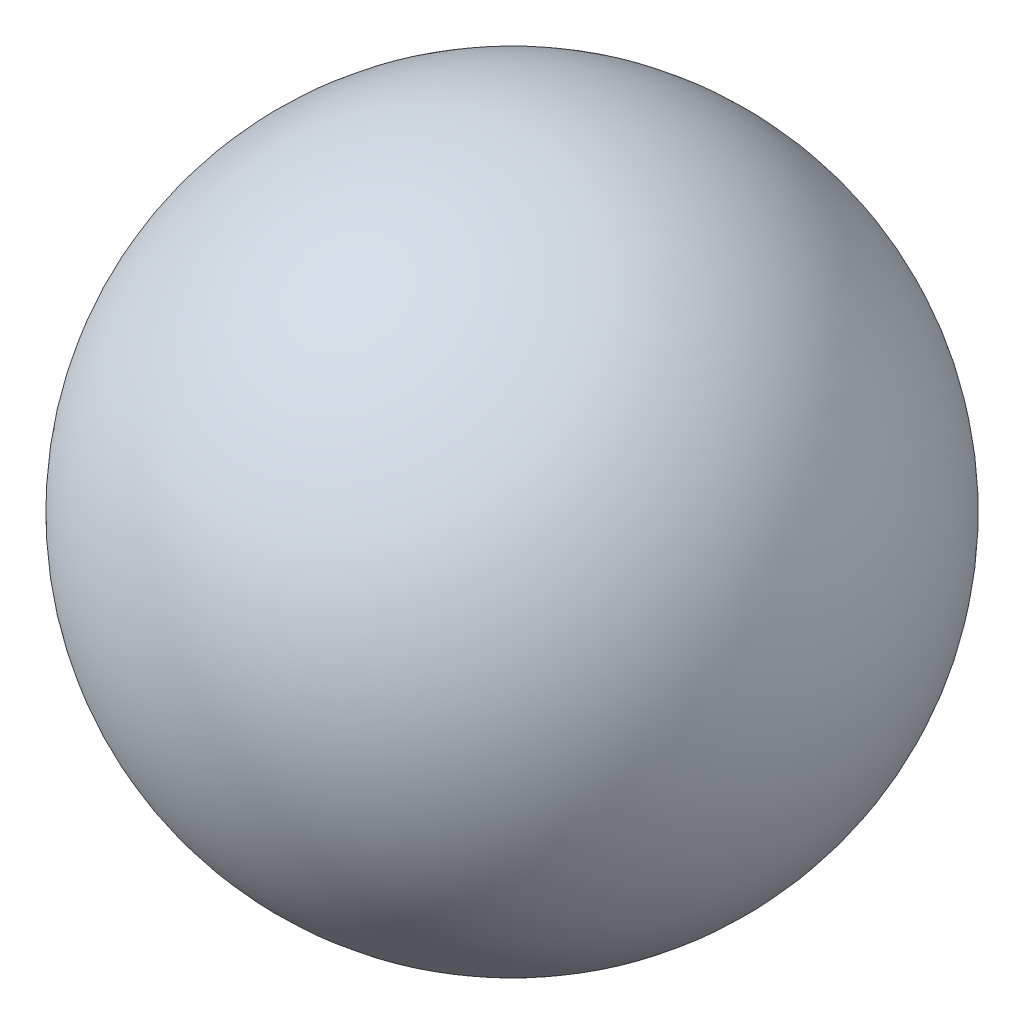
ISO-10303-21;
HEADER;
FILE_DESCRIPTION(('STEP AP214'),'2;1');
FILE_NAME('part.step','',(''),(''),'','','');
FILE_SCHEMA(('AUTOMOTIVE_DESIGN { 1 0 10303 214 1 1 1 1 }'));
ENDSEC;
DATA;
#1=APPLICATION_CONTEXT('core data for automotive mechanical design processes');
#2=APPLICATION_PROTOCOL_DEFINITION('international standard','automotive_design',2000,#1);
#3=PRODUCT_CONTEXT('',#1,'mechanical');
#4=PRODUCT('Part','Part','',(#3));
#5=PRODUCT_RELATED_PRODUCT_CATEGORY('part','',(#4));
#6=PRODUCT_DEFINITION_FORMATION('','',#4);
#7=PRODUCT_DEFINITION_CONTEXT('part definition',#1,'design');
#8=PRODUCT_DEFINITION('design','',#6,#7);
#9=PRODUCT_DEFINITION_SHAPE('','',#8);
#10=(LENGTH_UNIT() NAMED_UNIT(*) SI_UNIT(.MILLI.,.METRE.));
#11=(NAMED_UNIT(*) PLANE_ANGLE_UNIT() SI_UNIT($,.RADIAN.));
#12=(NAMED_UNIT(*) SI_UNIT($,.STERADIAN.) SOLID_ANGLE_UNIT());
#13=UNCERTAINTY_MEASURE_WITH_UNIT(LENGTH_MEASURE(1.E-05),#10,'distance_accuracy_value','');
#14=(GEOMETRIC_REPRESENTATION_CONTEXT(3) GLOBAL_UNCERTAINTY_ASSIGNED_CONTEXT((#13)) GLOBAL_UNIT_ASSIGNED_CONTEXT((#10,
#11,#12)) REPRESENTATION_CONTEXT('',''));
#15=CARTESIAN_POINT('',(0.,0.,0.));
#16=DIRECTION('',(0.,0.,1.));
#17=DIRECTION('',(1.,0.,0.));
#18=AXIS2_PLACEMENT_3D('',#15,#16,#17);
#19=CARTESIAN_POINT('',(0.,0.,0.));
#20=DIRECTION('',(0.,-1.,0.));
#21=DIRECTION('',(0.,0.,1.));
#22=AXIS2_PLACEMENT_3D('',#19,#20,#21);
#23=SPHERICAL_SURFACE('',#22,18.);
#24=CARTESIAN_POINT('',(0.,-18.,0.));
#25=VERTEX_POINT('',#24);
#26=VERTEX_LOOP('',#25);
#27=FACE_BOUND('',#26,.T.);
#28=ADVANCED_FACE('F37',(#27),#23,.T.);
#29=CLOSED_SHELL('',(#28));
#30=MANIFOLD_SOLID_BREP('B2',#29);
#31=ADVANCED_BREP_SHAPE_REPRESENTATION('',(#18,#30),#14);
#32=SHAPE_DEFINITION_REPRESENTATION(#9,#31);
ENDSEC;
END-ISO-10303-21;
